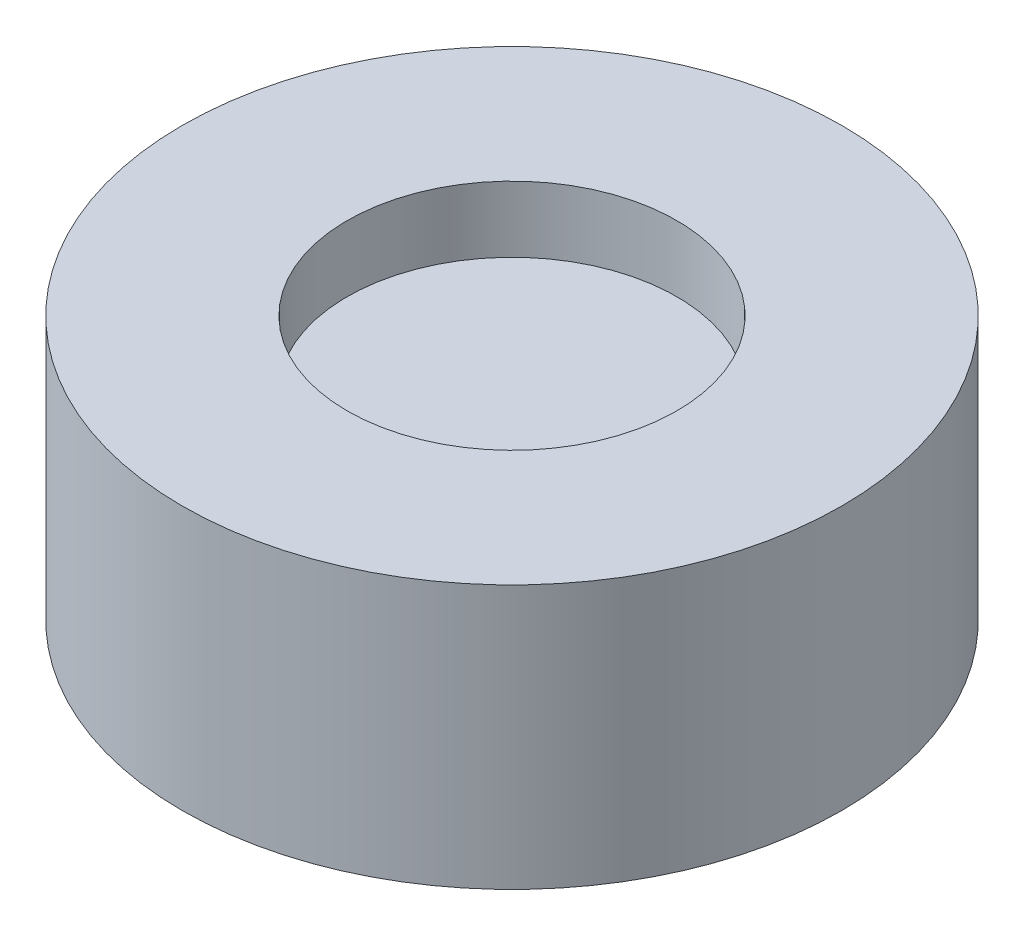
ISO-10303-21;
HEADER;
FILE_DESCRIPTION(('STEP AP214'),'2;1');
FILE_NAME('part.step','',(''),(''),'','','');
FILE_SCHEMA(('AUTOMOTIVE_DESIGN { 1 0 10303 214 1 1 1 1 }'));
ENDSEC;
DATA;
#1=APPLICATION_CONTEXT('core data for automotive mechanical design processes');
#2=APPLICATION_PROTOCOL_DEFINITION('international standard','automotive_design',2000,#1);
#3=PRODUCT_CONTEXT('',#1,'mechanical');
#4=PRODUCT('Part','Part','',(#3));
#5=PRODUCT_RELATED_PRODUCT_CATEGORY('part','',(#4));
#6=PRODUCT_DEFINITION_FORMATION('','',#4);
#7=PRODUCT_DEFINITION_CONTEXT('part definition',#1,'design');
#8=PRODUCT_DEFINITION('design','',#6,#7);
#9=PRODUCT_DEFINITION_SHAPE('','',#8);
#10=(LENGTH_UNIT() NAMED_UNIT(*) SI_UNIT(.MILLI.,.METRE.));
#11=(NAMED_UNIT(*) PLANE_ANGLE_UNIT() SI_UNIT($,.RADIAN.));
#12=(NAMED_UNIT(*) SI_UNIT($,.STERADIAN.) SOLID_ANGLE_UNIT());
#13=UNCERTAINTY_MEASURE_WITH_UNIT(LENGTH_MEASURE(1.E-05),#10,'distance_accuracy_value','');
#14=(GEOMETRIC_REPRESENTATION_CONTEXT(3) GLOBAL_UNCERTAINTY_ASSIGNED_CONTEXT((#13)) GLOBAL_UNIT_ASSIGNED_CONTEXT((#10,
#11,#12)) REPRESENTATION_CONTEXT('',''));
#15=CARTESIAN_POINT('',(0.,0.,0.));
#16=DIRECTION('',(0.,0.,1.));
#17=DIRECTION('',(1.,0.,0.));
#18=AXIS2_PLACEMENT_3D('',#15,#16,#17);
#19=CARTESIAN_POINT('',(0.,8.,0.));
#20=DIRECTION('',(0.,-1.,0.));
#21=DIRECTION('',(0.,0.,-1.));
#22=AXIS2_PLACEMENT_3D('',#19,#20,#21);
#23=CYLINDRICAL_SURFACE('',#22,10.);
#24=CARTESIAN_POINT('',(0.,8.,0.));
#25=DIRECTION('',(0.,1.,0.));
#26=DIRECTION('',(0.,0.,1.));
#27=AXIS2_PLACEMENT_3D('',#24,#25,#26);
#28=CIRCLE('',#27,10.);
#29=CARTESIAN_POINT('',(0.,8.,10.));
#30=VERTEX_POINT('',#29);
#31=EDGE_CURVE('E38',#30,#30,#28,.T.);
#32=ORIENTED_EDGE('',*,*,#31,.F.);
#33=EDGE_LOOP('',(#32));
#34=FACE_BOUND('',#33,.T.);
#35=CARTESIAN_POINT('',(0.,0.,0.));
#36=DIRECTION('',(0.,1.,0.));
#37=DIRECTION('',(0.,0.,1.));
#38=AXIS2_PLACEMENT_3D('',#35,#36,#37);
#39=CIRCLE('',#38,10.);
#40=CARTESIAN_POINT('',(0.,0.,10.));
#41=VERTEX_POINT('',#40);
#42=EDGE_CURVE('E42',#41,#41,#39,.T.);
#43=ORIENTED_EDGE('',*,*,#42,.T.);
#44=EDGE_LOOP('',(#43));
#45=FACE_BOUND('',#44,.T.);
#46=ADVANCED_FACE('F31',(#34,#45),#23,.T.);
#47=CARTESIAN_POINT('',(0.,8.,0.));
#48=DIRECTION('',(0.,1.,0.));
#49=DIRECTION('',(0.,0.,1.));
#50=AXIS2_PLACEMENT_3D('',#47,#48,#49);
#51=PLANE('',#50);
#52=CARTESIAN_POINT('',(0.,8.,0.));
#53=DIRECTION('',(0.,1.,0.));
#54=DIRECTION('',(0.,0.,1.));
#55=AXIS2_PLACEMENT_3D('',#52,#53,#54);
#56=CIRCLE('',#55,5.);
#57=CARTESIAN_POINT('',(0.,8.,5.));
#58=VERTEX_POINT('',#57);
#59=EDGE_CURVE('E49',#58,#58,#56,.T.);
#60=ORIENTED_EDGE('',*,*,#59,.F.);
#61=EDGE_LOOP('',(#60));
#62=FACE_BOUND('',#61,.T.);
#63=ORIENTED_EDGE('',*,*,#31,.T.);
#64=EDGE_LOOP('',(#63));
#65=FACE_BOUND('',#64,.T.);
#66=ADVANCED_FACE('F64',(#62,#65),#51,.T.);
#67=CARTESIAN_POINT('',(0.,0.,0.));
#68=DIRECTION('',(0.,1.,0.));
#69=DIRECTION('',(0.,0.,1.));
#70=AXIS2_PLACEMENT_3D('',#67,#68,#69);
#71=PLANE('',#70);
#72=CARTESIAN_POINT('',(0.,0.,0.));
#73=DIRECTION('',(0.,-1.,0.));
#74=DIRECTION('',(0.,0.,-1.));
#75=AXIS2_PLACEMENT_3D('',#72,#73,#74);
#76=CIRCLE('',#75,1.);
#77=CARTESIAN_POINT('',(0.,0.,-1.));
#78=VERTEX_POINT('',#77);
#79=EDGE_CURVE('E52',#78,#78,#76,.T.);
#80=ORIENTED_EDGE('',*,*,#79,.F.);
#81=EDGE_LOOP('',(#80));
#82=FACE_BOUND('',#81,.T.);
#83=ORIENTED_EDGE('',*,*,#42,.F.);
#84=EDGE_LOOP('',(#83));
#85=FACE_BOUND('',#84,.T.);
#86=ADVANCED_FACE('F60',(#82,#85),#71,.F.);
#87=CARTESIAN_POINT('',(0.,6.,0.));
#88=DIRECTION('',(0.,1.,0.));
#89=DIRECTION('',(0.,0.,1.));
#90=AXIS2_PLACEMENT_3D('',#87,#88,#89);
#91=CYLINDRICAL_SURFACE('',#90,5.);
#92=CARTESIAN_POINT('',(0.,6.,0.));
#93=DIRECTION('',(0.,1.,0.));
#94=DIRECTION('',(0.,0.,1.));
#95=AXIS2_PLACEMENT_3D('',#92,#93,#94);
#96=CIRCLE('',#95,5.);
#97=CARTESIAN_POINT('',(0.,6.,5.));
#98=VERTEX_POINT('',#97);
#99=EDGE_CURVE('E47',#98,#98,#96,.T.);
#100=ORIENTED_EDGE('',*,*,#99,.F.);
#101=EDGE_LOOP('',(#100));
#102=FACE_BOUND('',#101,.T.);
#103=ORIENTED_EDGE('',*,*,#59,.T.);
#104=EDGE_LOOP('',(#103));
#105=FACE_BOUND('',#104,.T.);
#106=ADVANCED_FACE('F63',(#102,#105),#91,.F.);
#107=CARTESIAN_POINT('',(0.,6.,0.));
#108=DIRECTION('',(0.,1.,0.));
#109=DIRECTION('',(0.,0.,1.));
#110=AXIS2_PLACEMENT_3D('',#107,#108,#109);
#111=PLANE('',#110);
#112=ORIENTED_EDGE('',*,*,#99,.T.);
#113=EDGE_LOOP('',(#112));
#114=FACE_BOUND('',#113,.T.);
#115=ADVANCED_FACE('F78',(#114),#111,.T.);
#116=CARTESIAN_POINT('',(0.,2.,0.));
#117=DIRECTION('',(0.,-1.,0.));
#118=DIRECTION('',(0.,0.,-1.));
#119=AXIS2_PLACEMENT_3D('',#116,#117,#118);
#120=CYLINDRICAL_SURFACE('',#119,1.);
#121=CARTESIAN_POINT('',(0.,1.,0.));
#122=DIRECTION('',(0.,-1.,0.));
#123=DIRECTION('',(0.,0.,-1.));
#124=AXIS2_PLACEMENT_3D('',#121,#122,#123);
#125=CIRCLE('',#124,1.);
#126=CARTESIAN_POINT('',(0.,1.,-1.));
#127=VERTEX_POINT('',#126);
#128=EDGE_CURVE('E10',#127,#127,#125,.F.);
#129=ORIENTED_EDGE('',*,*,#128,.T.);
#130=EDGE_LOOP('',(#129));
#131=FACE_BOUND('',#130,.T.);
#132=ORIENTED_EDGE('',*,*,#79,.T.);
#133=EDGE_LOOP('',(#132));
#134=FACE_BOUND('',#133,.T.);
#135=ADVANCED_FACE('F58',(#131,#134),#120,.F.);
#136=CARTESIAN_POINT('',(0.,1.,0.));
#137=DIRECTION('',(0.,-1.,0.));
#138=DIRECTION('',(0.,0.,-1.));
#139=AXIS2_PLACEMENT_3D('',#136,#137,#138);
#140=SPHERICAL_SURFACE('',#139,1.);
#141=ORIENTED_EDGE('',*,*,#128,.F.);
#142=EDGE_LOOP('',(#141));
#143=FACE_BOUND('',#142,.T.);
#144=ADVANCED_FACE('F33',(#143),#140,.F.);
#145=CLOSED_SHELL('',(#46,#66,#86,#106,#115,#135,#144));
#146=MANIFOLD_SOLID_BREP('B2',#145);
#147=ADVANCED_BREP_SHAPE_REPRESENTATION('',(#18,#146),#14);
#148=SHAPE_DEFINITION_REPRESENTATION(#9,#147);
ENDSEC;
END-ISO-10303-21;
